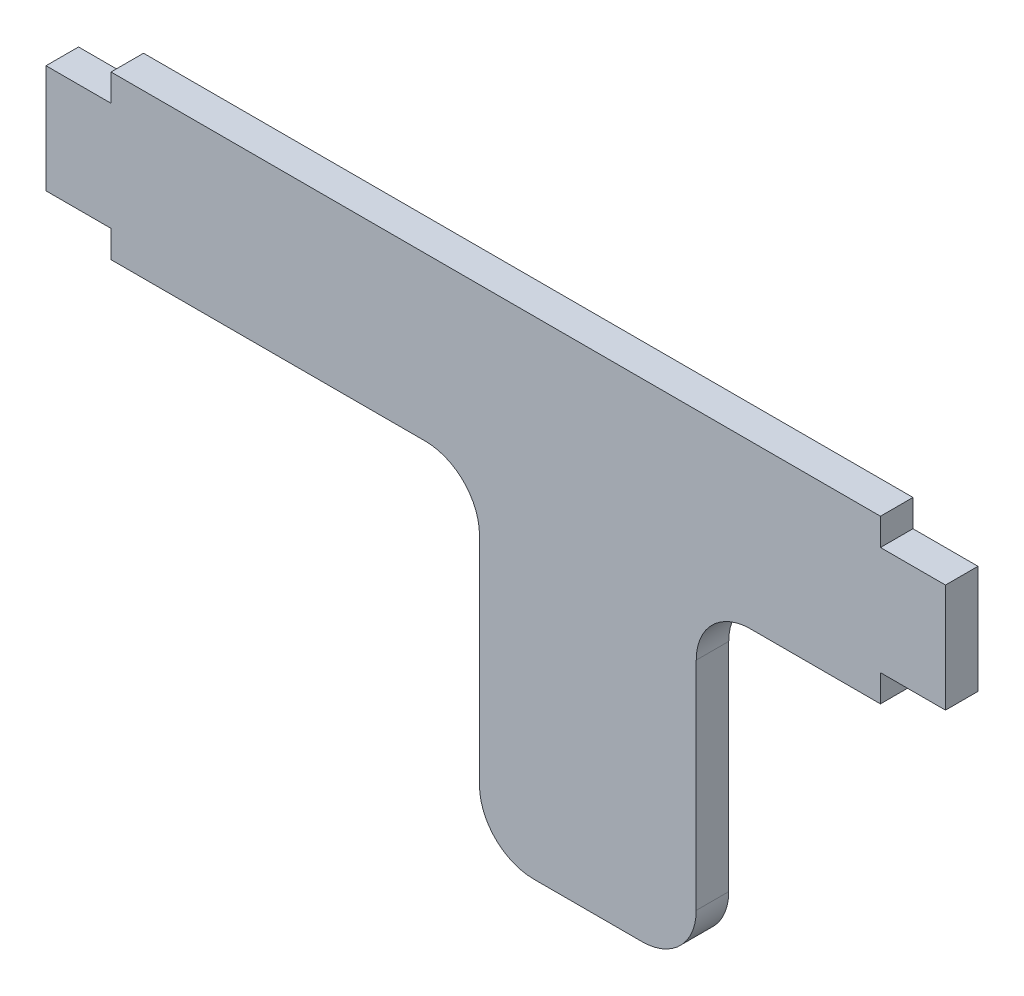
ISO-10303-21;
HEADER;
FILE_DESCRIPTION(('STEP AP214'),'2;1');
FILE_NAME('part.step','',(''),(''),'','','');
FILE_SCHEMA(('AUTOMOTIVE_DESIGN { 1 0 10303 214 1 1 1 1 }'));
ENDSEC;
DATA;
#1=APPLICATION_CONTEXT('core data for automotive mechanical design processes');
#2=APPLICATION_PROTOCOL_DEFINITION('international standard','automotive_design',2000,#1);
#3=PRODUCT_CONTEXT('',#1,'mechanical');
#4=PRODUCT('Part','Part','',(#3));
#5=PRODUCT_RELATED_PRODUCT_CATEGORY('part','',(#4));
#6=PRODUCT_DEFINITION_FORMATION('','',#4);
#7=PRODUCT_DEFINITION_CONTEXT('part definition',#1,'design');
#8=PRODUCT_DEFINITION('design','',#6,#7);
#9=PRODUCT_DEFINITION_SHAPE('','',#8);
#10=(LENGTH_UNIT() NAMED_UNIT(*) SI_UNIT(.MILLI.,.METRE.));
#11=(NAMED_UNIT(*) PLANE_ANGLE_UNIT() SI_UNIT($,.RADIAN.));
#12=(NAMED_UNIT(*) SI_UNIT($,.STERADIAN.) SOLID_ANGLE_UNIT());
#13=UNCERTAINTY_MEASURE_WITH_UNIT(LENGTH_MEASURE(1.E-05),#10,'distance_accuracy_value','');
#14=(GEOMETRIC_REPRESENTATION_CONTEXT(3) GLOBAL_UNCERTAINTY_ASSIGNED_CONTEXT((#13)) GLOBAL_UNIT_ASSIGNED_CONTEXT((#10,
#11,#12)) REPRESENTATION_CONTEXT('',''));
#15=CARTESIAN_POINT('',(0.,0.,0.));
#16=DIRECTION('',(0.,0.,1.));
#17=DIRECTION('',(1.,0.,0.));
#18=AXIS2_PLACEMENT_3D('',#15,#16,#17);
#19=CARTESIAN_POINT('',(-35.5,0.,3.));
#20=DIRECTION('',(-1.,0.,0.));
#21=DIRECTION('',(0.,0.,1.));
#22=AXIS2_PLACEMENT_3D('',#19,#20,#21);
#23=PLANE('',#22);
#24=DIRECTION('',(0.,1.,0.));
#25=VECTOR('',#24,1.);
#26=CARTESIAN_POINT('',(-35.5,0.,0.));
#27=LINE('',#26,#25);
#28=CARTESIAN_POINT('',(-35.5,-7.50000000000001,0.));
#29=VERTEX_POINT('',#28);
#30=CARTESIAN_POINT('',(-35.5,-5.,0.));
#31=VERTEX_POINT('',#30);
#32=EDGE_CURVE('E188',#29,#31,#27,.T.);
#33=ORIENTED_EDGE('',*,*,#32,.F.);
#34=DIRECTION('',(0.,0.,-1.));
#35=VECTOR('',#34,1.);
#36=CARTESIAN_POINT('',(-35.5,-7.50000000000001,3.));
#37=LINE('',#36,#35);
#38=CARTESIAN_POINT('',(-35.5,-7.50000000000001,3.));
#39=VERTEX_POINT('',#38);
#40=EDGE_CURVE('E176',#39,#29,#37,.T.);
#41=ORIENTED_EDGE('',*,*,#40,.F.);
#42=DIRECTION('',(0.,1.,0.));
#43=VECTOR('',#42,1.);
#44=CARTESIAN_POINT('',(-35.5,0.,3.));
#45=LINE('',#44,#43);
#46=CARTESIAN_POINT('',(-35.5,-5.,3.));
#47=VERTEX_POINT('',#46);
#48=EDGE_CURVE('E182',#39,#47,#45,.T.);
#49=ORIENTED_EDGE('',*,*,#48,.T.);
#50=DIRECTION('',(0.,0.,-1.));
#51=VECTOR('',#50,1.);
#52=CARTESIAN_POINT('',(-35.5,-5.,3.));
#53=LINE('',#52,#51);
#54=EDGE_CURVE('E225',#47,#31,#53,.T.);
#55=ORIENTED_EDGE('',*,*,#54,.T.);
#56=EDGE_LOOP('',(#33,#41,#49,#55));
#57=FACE_BOUND('',#56,.T.);
#58=ADVANCED_FACE('F35',(#57),#23,.T.);
#59=CARTESIAN_POINT('',(0.,-7.5,3.));
#60=DIRECTION('',(0.,-1.,0.));
#61=DIRECTION('',(1.,0.,0.));
#62=AXIS2_PLACEMENT_3D('',#59,#60,#61);
#63=PLANE('',#62);
#64=DIRECTION('',(-1.,0.,0.));
#65=VECTOR('',#64,1.);
#66=CARTESIAN_POINT('',(0.,-7.5,0.));
#67=LINE('',#66,#65);
#68=CARTESIAN_POINT('',(-6.5,-7.5,0.));
#69=VERTEX_POINT('',#68);
#70=EDGE_CURVE('E227',#69,#29,#67,.T.);
#71=ORIENTED_EDGE('',*,*,#70,.F.);
#72=DIRECTION('',(0.,0.,-1.));
#73=VECTOR('',#72,1.);
#74=CARTESIAN_POINT('',(-6.5,-7.5,3.));
#75=LINE('',#74,#73);
#76=CARTESIAN_POINT('',(-6.5,-7.5,3.));
#77=VERTEX_POINT('',#76);
#78=EDGE_CURVE('E179',#69,#77,#75,.F.);
#79=ORIENTED_EDGE('',*,*,#78,.T.);
#80=DIRECTION('',(-1.,0.,0.));
#81=VECTOR('',#80,1.);
#82=CARTESIAN_POINT('',(0.,-7.5,3.));
#83=LINE('',#82,#81);
#84=EDGE_CURVE('E172',#77,#39,#83,.T.);
#85=ORIENTED_EDGE('',*,*,#84,.T.);
#86=ORIENTED_EDGE('',*,*,#40,.T.);
#87=EDGE_LOOP('',(#71,#79,#85,#86));
#88=FACE_BOUND('',#87,.T.);
#89=ADVANCED_FACE('F175',(#88),#63,.T.);
#90=CARTESIAN_POINT('',(-1.49999999999999,0.,3.));
#91=DIRECTION('',(-1.,0.,0.));
#92=DIRECTION('',(0.,0.,1.));
#93=AXIS2_PLACEMENT_3D('',#90,#91,#92);
#94=PLANE('',#93);
#95=DIRECTION('',(0.,1.,0.));
#96=VECTOR('',#95,1.);
#97=CARTESIAN_POINT('',(-1.49999999999999,0.,0.));
#98=LINE('',#97,#96);
#99=CARTESIAN_POINT('',(-1.49999999999999,-32.5,0.));
#100=VERTEX_POINT('',#99);
#101=CARTESIAN_POINT('',(-1.49999999999999,-12.5,0.));
#102=VERTEX_POINT('',#101);
#103=EDGE_CURVE('E230',#100,#102,#98,.T.);
#104=ORIENTED_EDGE('',*,*,#103,.F.);
#105=DIRECTION('',(0.,0.,-1.));
#106=VECTOR('',#105,1.);
#107=CARTESIAN_POINT('',(-1.49999999999999,-32.5,3.));
#108=LINE('',#107,#106);
#109=CARTESIAN_POINT('',(-1.49999999999999,-32.5,3.));
#110=VERTEX_POINT('',#109);
#111=EDGE_CURVE('E302',#100,#110,#108,.F.);
#112=ORIENTED_EDGE('',*,*,#111,.T.);
#113=DIRECTION('',(0.,1.,0.));
#114=VECTOR('',#113,1.);
#115=CARTESIAN_POINT('',(-1.49999999999999,0.,3.));
#116=LINE('',#115,#114);
#117=CARTESIAN_POINT('',(-1.49999999999999,-12.5,3.));
#118=VERTEX_POINT('',#117);
#119=EDGE_CURVE('E181',#110,#118,#116,.T.);
#120=ORIENTED_EDGE('',*,*,#119,.T.);
#121=DIRECTION('',(0.,0.,-1.));
#122=VECTOR('',#121,1.);
#123=CARTESIAN_POINT('',(-1.49999999999999,-12.5,0.));
#124=LINE('',#123,#122);
#125=EDGE_CURVE('E299',#118,#102,#124,.T.);
#126=ORIENTED_EDGE('',*,*,#125,.T.);
#127=EDGE_LOOP('',(#104,#112,#120,#126));
#128=FACE_BOUND('',#127,.T.);
#129=ADVANCED_FACE('F370',(#128),#94,.T.);
#130=CARTESIAN_POINT('',(0.,-37.5,3.));
#131=DIRECTION('',(0.,-1.,0.));
#132=DIRECTION('',(0.,0.,-1.));
#133=AXIS2_PLACEMENT_3D('',#130,#131,#132);
#134=PLANE('',#133);
#135=DIRECTION('',(-1.,0.,0.));
#136=VECTOR('',#135,1.);
#137=CARTESIAN_POINT('',(0.,-37.5,0.));
#138=LINE('',#137,#136);
#139=CARTESIAN_POINT('',(13.5,-37.5,0.));
#140=VERTEX_POINT('',#139);
#141=CARTESIAN_POINT('',(3.50000000000001,-37.5,0.));
#142=VERTEX_POINT('',#141);
#143=EDGE_CURVE('E234',#140,#142,#138,.T.);
#144=ORIENTED_EDGE('',*,*,#143,.F.);
#145=DIRECTION('',(0.,0.,-1.));
#146=VECTOR('',#145,1.);
#147=CARTESIAN_POINT('',(13.5,-37.5,3.));
#148=LINE('',#147,#146);
#149=CARTESIAN_POINT('',(13.5,-37.5,3.));
#150=VERTEX_POINT('',#149);
#151=EDGE_CURVE('E293',#140,#150,#148,.F.);
#152=ORIENTED_EDGE('',*,*,#151,.T.);
#153=DIRECTION('',(-1.,0.,0.));
#154=VECTOR('',#153,1.);
#155=CARTESIAN_POINT('',(0.,-37.5,3.));
#156=LINE('',#155,#154);
#157=CARTESIAN_POINT('',(3.50000000000001,-37.5,3.));
#158=VERTEX_POINT('',#157);
#159=EDGE_CURVE('E328',#150,#158,#156,.T.);
#160=ORIENTED_EDGE('',*,*,#159,.T.);
#161=DIRECTION('',(0.,0.,-1.));
#162=VECTOR('',#161,1.);
#163=CARTESIAN_POINT('',(3.50000000000001,-37.5,3.));
#164=LINE('',#163,#162);
#165=EDGE_CURVE('E290',#158,#142,#164,.T.);
#166=ORIENTED_EDGE('',*,*,#165,.T.);
#167=EDGE_LOOP('',(#144,#152,#160,#166));
#168=FACE_BOUND('',#167,.T.);
#169=ADVANCED_FACE('F378',(#168),#134,.T.);
#170=CARTESIAN_POINT('',(18.5,0.,3.));
#171=DIRECTION('',(-1.,0.,0.));
#172=DIRECTION('',(0.,0.,1.));
#173=AXIS2_PLACEMENT_3D('',#170,#171,#172);
#174=PLANE('',#173);
#175=DIRECTION('',(0.,1.,0.));
#176=VECTOR('',#175,1.);
#177=CARTESIAN_POINT('',(18.5,0.,3.));
#178=LINE('',#177,#176);
#179=CARTESIAN_POINT('',(18.5,-32.5,3.));
#180=VERTEX_POINT('',#179);
#181=CARTESIAN_POINT('',(18.5,-12.5,3.));
#182=VERTEX_POINT('',#181);
#183=EDGE_CURVE('E326',#180,#182,#178,.T.);
#184=ORIENTED_EDGE('',*,*,#183,.F.);
#185=DIRECTION('',(0.,0.,-1.));
#186=VECTOR('',#185,1.);
#187=CARTESIAN_POINT('',(18.5,-32.5,0.));
#188=LINE('',#187,#186);
#189=CARTESIAN_POINT('',(18.5,-32.5,0.));
#190=VERTEX_POINT('',#189);
#191=EDGE_CURVE('E283',#180,#190,#188,.T.);
#192=ORIENTED_EDGE('',*,*,#191,.T.);
#193=DIRECTION('',(0.,1.,0.));
#194=VECTOR('',#193,1.);
#195=CARTESIAN_POINT('',(18.5,0.,0.));
#196=LINE('',#195,#194);
#197=CARTESIAN_POINT('',(18.5,-12.5,0.));
#198=VERTEX_POINT('',#197);
#199=EDGE_CURVE('E237',#190,#198,#196,.T.);
#200=ORIENTED_EDGE('',*,*,#199,.T.);
#201=DIRECTION('',(0.,0.,-1.));
#202=VECTOR('',#201,1.);
#203=CARTESIAN_POINT('',(18.5,-12.5,3.));
#204=LINE('',#203,#202);
#205=EDGE_CURVE('E189',#198,#182,#204,.F.);
#206=ORIENTED_EDGE('',*,*,#205,.T.);
#207=EDGE_LOOP('',(#184,#192,#200,#206));
#208=FACE_BOUND('',#207,.T.);
#209=ADVANCED_FACE('F321',(#208),#174,.F.);
#210=CARTESIAN_POINT('',(35.5,-7.5,3.));
#211=VERTEX_POINT('',#210);
#212=CARTESIAN_POINT('',(23.5,-7.5,3.));
#213=VERTEX_POINT('',#212);
#214=EDGE_CURVE('E184',#211,#213,#83,.T.);
#215=ORIENTED_EDGE('',*,*,#214,.T.);
#216=DIRECTION('',(0.,0.,-1.));
#217=VECTOR('',#216,1.);
#218=CARTESIAN_POINT('',(23.5,-7.5,3.));
#219=LINE('',#218,#217);
#220=CARTESIAN_POINT('',(23.5,-7.5,0.));
#221=VERTEX_POINT('',#220);
#222=EDGE_CURVE('E305',#213,#221,#219,.T.);
#223=ORIENTED_EDGE('',*,*,#222,.T.);
#224=CARTESIAN_POINT('',(35.5,-7.5,0.));
#225=VERTEX_POINT('',#224);
#226=EDGE_CURVE('E231',#225,#221,#67,.T.);
#227=ORIENTED_EDGE('',*,*,#226,.F.);
#228=DIRECTION('',(0.,0.,-1.));
#229=VECTOR('',#228,1.);
#230=CARTESIAN_POINT('',(35.5,-7.5,3.));
#231=LINE('',#230,#229);
#232=EDGE_CURVE('E190',#211,#225,#231,.T.);
#233=ORIENTED_EDGE('',*,*,#232,.F.);
#234=EDGE_LOOP('',(#215,#223,#227,#233));
#235=FACE_BOUND('',#234,.T.);
#236=ADVANCED_FACE('F324',(#235),#63,.T.);
#237=CARTESIAN_POINT('',(35.5,0.,3.));
#238=DIRECTION('',(-1.,0.,0.));
#239=DIRECTION('',(0.,0.,1.));
#240=AXIS2_PLACEMENT_3D('',#237,#238,#239);
#241=PLANE('',#240);
#242=DIRECTION('',(0.,1.,0.));
#243=VECTOR('',#242,1.);
#244=CARTESIAN_POINT('',(35.5,0.,0.));
#245=LINE('',#244,#243);
#246=CARTESIAN_POINT('',(35.5,-5.,0.));
#247=VERTEX_POINT('',#246);
#248=EDGE_CURVE('E240',#225,#247,#245,.T.);
#249=ORIENTED_EDGE('',*,*,#248,.T.);
#250=DIRECTION('',(0.,0.,-1.));
#251=VECTOR('',#250,1.);
#252=CARTESIAN_POINT('',(35.5,-5.,3.));
#253=LINE('',#252,#251);
#254=CARTESIAN_POINT('',(35.5,-5.,3.));
#255=VERTEX_POINT('',#254);
#256=EDGE_CURVE('E279',#255,#247,#253,.T.);
#257=ORIENTED_EDGE('',*,*,#256,.F.);
#258=DIRECTION('',(0.,1.,0.));
#259=VECTOR('',#258,1.);
#260=CARTESIAN_POINT('',(35.5,0.,3.));
#261=LINE('',#260,#259);
#262=EDGE_CURVE('E218',#211,#255,#261,.T.);
#263=ORIENTED_EDGE('',*,*,#262,.F.);
#264=ORIENTED_EDGE('',*,*,#232,.T.);
#265=EDGE_LOOP('',(#249,#257,#263,#264));
#266=FACE_BOUND('',#265,.T.);
#267=ADVANCED_FACE('F409',(#266),#241,.F.);
#268=CARTESIAN_POINT('',(0.,-5.,3.));
#269=DIRECTION('',(0.,-1.,0.));
#270=DIRECTION('',(0.,0.,-1.));
#271=AXIS2_PLACEMENT_3D('',#268,#269,#270);
#272=PLANE('',#271);
#273=DIRECTION('',(-1.,0.,0.));
#274=VECTOR('',#273,1.);
#275=CARTESIAN_POINT('',(0.,-5.,0.));
#276=LINE('',#275,#274);
#277=CARTESIAN_POINT('',(41.5,-5.,0.));
#278=VERTEX_POINT('',#277);
#279=EDGE_CURVE('E243',#278,#247,#276,.T.);
#280=ORIENTED_EDGE('',*,*,#279,.F.);
#281=DIRECTION('',(0.,0.,-1.));
#282=VECTOR('',#281,1.);
#283=CARTESIAN_POINT('',(41.5,-5.,3.));
#284=LINE('',#283,#282);
#285=CARTESIAN_POINT('',(41.5,-5.,3.));
#286=VERTEX_POINT('',#285);
#287=EDGE_CURVE('E277',#286,#278,#284,.T.);
#288=ORIENTED_EDGE('',*,*,#287,.F.);
#289=DIRECTION('',(-1.,0.,0.));
#290=VECTOR('',#289,1.);
#291=CARTESIAN_POINT('',(0.,-5.,3.));
#292=LINE('',#291,#290);
#293=EDGE_CURVE('E327',#286,#255,#292,.T.);
#294=ORIENTED_EDGE('',*,*,#293,.T.);
#295=ORIENTED_EDGE('',*,*,#256,.T.);
#296=EDGE_LOOP('',(#280,#288,#294,#295));
#297=FACE_BOUND('',#296,.T.);
#298=ADVANCED_FACE('F416',(#297),#272,.T.);
#299=CARTESIAN_POINT('',(41.5,0.,3.));
#300=DIRECTION('',(-1.,0.,0.));
#301=DIRECTION('',(0.,0.,1.));
#302=AXIS2_PLACEMENT_3D('',#299,#300,#301);
#303=PLANE('',#302);
#304=DIRECTION('',(0.,1.,0.));
#305=VECTOR('',#304,1.);
#306=CARTESIAN_POINT('',(41.5,0.,0.));
#307=LINE('',#306,#305);
#308=CARTESIAN_POINT('',(41.5,5.,0.));
#309=VERTEX_POINT('',#308);
#310=EDGE_CURVE('E247',#278,#309,#307,.T.);
#311=ORIENTED_EDGE('',*,*,#310,.T.);
#312=DIRECTION('',(0.,0.,-1.));
#313=VECTOR('',#312,1.);
#314=CARTESIAN_POINT('',(41.5,5.,3.));
#315=LINE('',#314,#313);
#316=CARTESIAN_POINT('',(41.5,5.,3.));
#317=VERTEX_POINT('',#316);
#318=EDGE_CURVE('E274',#317,#309,#315,.T.);
#319=ORIENTED_EDGE('',*,*,#318,.F.);
#320=DIRECTION('',(0.,1.,0.));
#321=VECTOR('',#320,1.);
#322=CARTESIAN_POINT('',(41.5,0.,3.));
#323=LINE('',#322,#321);
#324=EDGE_CURVE('E335',#286,#317,#323,.T.);
#325=ORIENTED_EDGE('',*,*,#324,.F.);
#326=ORIENTED_EDGE('',*,*,#287,.T.);
#327=EDGE_LOOP('',(#311,#319,#325,#326));
#328=FACE_BOUND('',#327,.T.);
#329=ADVANCED_FACE('F413',(#328),#303,.F.);
#330=CARTESIAN_POINT('',(0.,5.,3.));
#331=DIRECTION('',(0.,-1.,0.));
#332=DIRECTION('',(0.,0.,-1.));
#333=AXIS2_PLACEMENT_3D('',#330,#331,#332);
#334=PLANE('',#333);
#335=DIRECTION('',(-1.,0.,0.));
#336=VECTOR('',#335,1.);
#337=CARTESIAN_POINT('',(0.,5.,0.));
#338=LINE('',#337,#336);
#339=CARTESIAN_POINT('',(35.5,5.,0.));
#340=VERTEX_POINT('',#339);
#341=EDGE_CURVE('E249',#309,#340,#338,.T.);
#342=ORIENTED_EDGE('',*,*,#341,.T.);
#343=DIRECTION('',(0.,0.,-1.));
#344=VECTOR('',#343,1.);
#345=CARTESIAN_POINT('',(35.5,5.,3.));
#346=LINE('',#345,#344);
#347=CARTESIAN_POINT('',(35.5,5.,3.));
#348=VERTEX_POINT('',#347);
#349=EDGE_CURVE('E271',#348,#340,#346,.T.);
#350=ORIENTED_EDGE('',*,*,#349,.F.);
#351=DIRECTION('',(-1.,0.,0.));
#352=VECTOR('',#351,1.);
#353=CARTESIAN_POINT('',(0.,5.,3.));
#354=LINE('',#353,#352);
#355=EDGE_CURVE('E216',#317,#348,#354,.T.);
#356=ORIENTED_EDGE('',*,*,#355,.F.);
#357=ORIENTED_EDGE('',*,*,#318,.T.);
#358=EDGE_LOOP('',(#342,#350,#356,#357));
#359=FACE_BOUND('',#358,.T.);
#360=ADVANCED_FACE('F344',(#359),#334,.F.);
#361=CARTESIAN_POINT('',(35.5,7.5,0.));
#362=VERTEX_POINT('',#361);
#363=EDGE_CURVE('E244',#340,#362,#245,.T.);
#364=ORIENTED_EDGE('',*,*,#363,.T.);
#365=DIRECTION('',(0.,0.,-1.));
#366=VECTOR('',#365,1.);
#367=CARTESIAN_POINT('',(35.5,7.5,3.));
#368=LINE('',#367,#366);
#369=CARTESIAN_POINT('',(35.5,7.5,3.));
#370=VERTEX_POINT('',#369);
#371=EDGE_CURVE('E268',#370,#362,#368,.T.);
#372=ORIENTED_EDGE('',*,*,#371,.F.);
#373=EDGE_CURVE('E212',#348,#370,#261,.T.);
#374=ORIENTED_EDGE('',*,*,#373,.F.);
#375=ORIENTED_EDGE('',*,*,#349,.T.);
#376=EDGE_LOOP('',(#364,#372,#374,#375));
#377=FACE_BOUND('',#376,.T.);
#378=ADVANCED_FACE('F348',(#377),#241,.F.);
#379=CARTESIAN_POINT('',(0.,7.5,3.));
#380=DIRECTION('',(0.,-1.,0.));
#381=DIRECTION('',(1.,0.,0.));
#382=AXIS2_PLACEMENT_3D('',#379,#380,#381);
#383=PLANE('',#382);
#384=DIRECTION('',(-1.,0.,0.));
#385=VECTOR('',#384,1.);
#386=CARTESIAN_POINT('',(0.,7.5,0.));
#387=LINE('',#386,#385);
#388=CARTESIAN_POINT('',(-35.5,7.49999999999999,0.));
#389=VERTEX_POINT('',#388);
#390=EDGE_CURVE('E251',#362,#389,#387,.T.);
#391=ORIENTED_EDGE('',*,*,#390,.T.);
#392=DIRECTION('',(0.,0.,-1.));
#393=VECTOR('',#392,1.);
#394=CARTESIAN_POINT('',(-35.5,7.49999999999999,3.));
#395=LINE('',#394,#393);
#396=CARTESIAN_POINT('',(-35.5,7.49999999999999,3.));
#397=VERTEX_POINT('',#396);
#398=EDGE_CURVE('E266',#397,#389,#395,.T.);
#399=ORIENTED_EDGE('',*,*,#398,.F.);
#400=DIRECTION('',(-1.,0.,0.));
#401=VECTOR('',#400,1.);
#402=CARTESIAN_POINT('',(0.,7.5,3.));
#403=LINE('',#402,#401);
#404=EDGE_CURVE('E206',#370,#397,#403,.T.);
#405=ORIENTED_EDGE('',*,*,#404,.F.);
#406=ORIENTED_EDGE('',*,*,#371,.T.);
#407=EDGE_LOOP('',(#391,#399,#405,#406));
#408=FACE_BOUND('',#407,.T.);
#409=ADVANCED_FACE('F351',(#408),#383,.F.);
#410=CARTESIAN_POINT('',(-35.5,5.,0.));
#411=VERTEX_POINT('',#410);
#412=EDGE_CURVE('E228',#411,#389,#27,.T.);
#413=ORIENTED_EDGE('',*,*,#412,.F.);
#414=DIRECTION('',(0.,0.,-1.));
#415=VECTOR('',#414,1.);
#416=CARTESIAN_POINT('',(-35.5,5.,3.));
#417=LINE('',#416,#415);
#418=CARTESIAN_POINT('',(-35.5,5.,3.));
#419=VERTEX_POINT('',#418);
#420=EDGE_CURVE('E264',#419,#411,#417,.T.);
#421=ORIENTED_EDGE('',*,*,#420,.F.);
#422=EDGE_CURVE('E200',#419,#397,#45,.T.);
#423=ORIENTED_EDGE('',*,*,#422,.T.);
#424=ORIENTED_EDGE('',*,*,#398,.T.);
#425=EDGE_LOOP('',(#413,#421,#423,#424));
#426=FACE_BOUND('',#425,.T.);
#427=ADVANCED_FACE('F354',(#426),#23,.T.);
#428=CARTESIAN_POINT('',(0.,5.,3.));
#429=DIRECTION('',(0.,1.,0.));
#430=DIRECTION('',(0.,0.,1.));
#431=AXIS2_PLACEMENT_3D('',#428,#429,#430);
#432=PLANE('',#431);
#433=DIRECTION('',(1.,0.,0.));
#434=VECTOR('',#433,1.);
#435=CARTESIAN_POINT('',(0.,5.,0.));
#436=LINE('',#435,#434);
#437=CARTESIAN_POINT('',(-41.5,5.,0.));
#438=VERTEX_POINT('',#437);
#439=EDGE_CURVE('E254',#438,#411,#436,.T.);
#440=ORIENTED_EDGE('',*,*,#439,.F.);
#441=DIRECTION('',(0.,0.,-1.));
#442=VECTOR('',#441,1.);
#443=CARTESIAN_POINT('',(-41.5,5.,3.));
#444=LINE('',#443,#442);
#445=CARTESIAN_POINT('',(-41.5,5.,3.));
#446=VERTEX_POINT('',#445);
#447=EDGE_CURVE('E262',#446,#438,#444,.T.);
#448=ORIENTED_EDGE('',*,*,#447,.F.);
#449=DIRECTION('',(1.,0.,0.));
#450=VECTOR('',#449,1.);
#451=CARTESIAN_POINT('',(0.,5.,3.));
#452=LINE('',#451,#450);
#453=EDGE_CURVE('E205',#446,#419,#452,.T.);
#454=ORIENTED_EDGE('',*,*,#453,.T.);
#455=ORIENTED_EDGE('',*,*,#420,.T.);
#456=EDGE_LOOP('',(#440,#448,#454,#455));
#457=FACE_BOUND('',#456,.T.);
#458=ADVANCED_FACE('F359',(#457),#432,.T.);
#459=CARTESIAN_POINT('',(-41.5,0.,3.));
#460=DIRECTION('',(-1.,0.,0.));
#461=DIRECTION('',(0.,0.,1.));
#462=AXIS2_PLACEMENT_3D('',#459,#460,#461);
#463=PLANE('',#462);
#464=DIRECTION('',(0.,1.,0.));
#465=VECTOR('',#464,1.);
#466=CARTESIAN_POINT('',(-41.5,0.,0.));
#467=LINE('',#466,#465);
#468=CARTESIAN_POINT('',(-41.5,-5.,0.));
#469=VERTEX_POINT('',#468);
#470=EDGE_CURVE('E202',#469,#438,#467,.T.);
#471=ORIENTED_EDGE('',*,*,#470,.F.);
#472=DIRECTION('',(0.,0.,-1.));
#473=VECTOR('',#472,1.);
#474=CARTESIAN_POINT('',(-41.5,-5.,3.));
#475=LINE('',#474,#473);
#476=CARTESIAN_POINT('',(-41.5,-5.,3.));
#477=VERTEX_POINT('',#476);
#478=EDGE_CURVE('E260',#477,#469,#475,.T.);
#479=ORIENTED_EDGE('',*,*,#478,.F.);
#480=DIRECTION('',(0.,1.,0.));
#481=VECTOR('',#480,1.);
#482=CARTESIAN_POINT('',(-41.5,0.,3.));
#483=LINE('',#482,#481);
#484=EDGE_CURVE('E210',#477,#446,#483,.T.);
#485=ORIENTED_EDGE('',*,*,#484,.T.);
#486=ORIENTED_EDGE('',*,*,#447,.T.);
#487=EDGE_LOOP('',(#471,#479,#485,#486));
#488=FACE_BOUND('',#487,.T.);
#489=ADVANCED_FACE('F362',(#488),#463,.T.);
#490=CARTESIAN_POINT('',(0.,-5.,3.));
#491=DIRECTION('',(0.,1.,0.));
#492=DIRECTION('',(0.,0.,1.));
#493=AXIS2_PLACEMENT_3D('',#490,#491,#492);
#494=PLANE('',#493);
#495=DIRECTION('',(1.,0.,0.));
#496=VECTOR('',#495,1.);
#497=CARTESIAN_POINT('',(0.,-5.,0.));
#498=LINE('',#497,#496);
#499=EDGE_CURVE('E198',#469,#31,#498,.T.);
#500=ORIENTED_EDGE('',*,*,#499,.T.);
#501=ORIENTED_EDGE('',*,*,#54,.F.);
#502=DIRECTION('',(1.,0.,0.));
#503=VECTOR('',#502,1.);
#504=CARTESIAN_POINT('',(0.,-5.,3.));
#505=LINE('',#504,#503);
#506=EDGE_CURVE('E196',#477,#47,#505,.T.);
#507=ORIENTED_EDGE('',*,*,#506,.F.);
#508=ORIENTED_EDGE('',*,*,#478,.T.);
#509=EDGE_LOOP('',(#500,#501,#507,#508));
#510=FACE_BOUND('',#509,.T.);
#511=ADVANCED_FACE('F364',(#510),#494,.F.);
#512=CARTESIAN_POINT('',(0.,0.,3.));
#513=DIRECTION('',(0.,0.,1.));
#514=DIRECTION('',(1.,0.,0.));
#515=AXIS2_PLACEMENT_3D('',#512,#513,#514);
#516=PLANE('',#515);
#517=ORIENTED_EDGE('',*,*,#159,.F.);
#518=CARTESIAN_POINT('',(13.5,-32.5,3.));
#519=DIRECTION('',(0.,0.,1.));
#520=DIRECTION('',(1.,0.,0.));
#521=AXIS2_PLACEMENT_3D('',#518,#519,#520);
#522=CIRCLE('',#521,5.);
#523=EDGE_CURVE('E297',#150,#180,#522,.T.);
#524=ORIENTED_EDGE('',*,*,#523,.T.);
#525=ORIENTED_EDGE('',*,*,#183,.T.);
#526=CARTESIAN_POINT('',(23.5,-12.5,3.));
#527=DIRECTION('',(0.,0.,1.));
#528=DIRECTION('',(1.,0.,0.));
#529=AXIS2_PLACEMENT_3D('',#526,#527,#528);
#530=CIRCLE('',#529,5.);
#531=EDGE_CURVE('E11',#182,#213,#530,.F.);
#532=ORIENTED_EDGE('',*,*,#531,.T.);
#533=ORIENTED_EDGE('',*,*,#214,.F.);
#534=ORIENTED_EDGE('',*,*,#262,.T.);
#535=ORIENTED_EDGE('',*,*,#293,.F.);
#536=ORIENTED_EDGE('',*,*,#324,.T.);
#537=ORIENTED_EDGE('',*,*,#355,.T.);
#538=ORIENTED_EDGE('',*,*,#373,.T.);
#539=ORIENTED_EDGE('',*,*,#404,.T.);
#540=ORIENTED_EDGE('',*,*,#422,.F.);
#541=ORIENTED_EDGE('',*,*,#453,.F.);
#542=ORIENTED_EDGE('',*,*,#484,.F.);
#543=ORIENTED_EDGE('',*,*,#506,.T.);
#544=ORIENTED_EDGE('',*,*,#48,.F.);
#545=ORIENTED_EDGE('',*,*,#84,.F.);
#546=CARTESIAN_POINT('',(-6.49999999999999,-12.5,3.));
#547=DIRECTION('',(0.,0.,1.));
#548=DIRECTION('',(1.,0.,0.));
#549=AXIS2_PLACEMENT_3D('',#546,#547,#548);
#550=CIRCLE('',#549,5.);
#551=EDGE_CURVE('E55',#77,#118,#550,.F.);
#552=ORIENTED_EDGE('',*,*,#551,.T.);
#553=ORIENTED_EDGE('',*,*,#119,.F.);
#554=CARTESIAN_POINT('',(3.50000000000001,-32.5,3.));
#555=DIRECTION('',(0.,0.,1.));
#556=DIRECTION('',(1.,0.,0.));
#557=AXIS2_PLACEMENT_3D('',#554,#555,#556);
#558=CIRCLE('',#557,5.);
#559=EDGE_CURVE('E295',#110,#158,#558,.T.);
#560=ORIENTED_EDGE('',*,*,#559,.T.);
#561=EDGE_LOOP('',(#517,#524,#525,#532,#533,#534,#535,#536,#537,#538,#539,#540,#541,#542,#543,
#544,#545,#552,#553,#560));
#562=FACE_BOUND('',#561,.T.);
#563=ADVANCED_FACE('F193',(#562),#516,.T.);
#564=CARTESIAN_POINT('',(0.,0.,0.));
#565=DIRECTION('',(0.,0.,1.));
#566=DIRECTION('',(1.,0.,0.));
#567=AXIS2_PLACEMENT_3D('',#564,#565,#566);
#568=PLANE('',#567);
#569=ORIENTED_EDGE('',*,*,#199,.F.);
#570=CARTESIAN_POINT('',(13.5,-32.5,0.));
#571=DIRECTION('',(0.,0.,1.));
#572=DIRECTION('',(1.,0.,0.));
#573=AXIS2_PLACEMENT_3D('',#570,#571,#572);
#574=CIRCLE('',#573,5.);
#575=EDGE_CURVE('E288',#190,#140,#574,.F.);
#576=ORIENTED_EDGE('',*,*,#575,.T.);
#577=ORIENTED_EDGE('',*,*,#143,.T.);
#578=CARTESIAN_POINT('',(3.50000000000001,-32.5,0.));
#579=DIRECTION('',(0.,0.,1.));
#580=DIRECTION('',(1.,0.,0.));
#581=AXIS2_PLACEMENT_3D('',#578,#579,#580);
#582=CIRCLE('',#581,5.);
#583=EDGE_CURVE('E286',#142,#100,#582,.F.);
#584=ORIENTED_EDGE('',*,*,#583,.T.);
#585=ORIENTED_EDGE('',*,*,#103,.T.);
#586=CARTESIAN_POINT('',(-6.49999999999999,-12.5,0.));
#587=DIRECTION('',(0.,0.,1.));
#588=DIRECTION('',(1.,0.,0.));
#589=AXIS2_PLACEMENT_3D('',#586,#587,#588);
#590=CIRCLE('',#589,5.);
#591=EDGE_CURVE('E308',#102,#69,#590,.T.);
#592=ORIENTED_EDGE('',*,*,#591,.T.);
#593=ORIENTED_EDGE('',*,*,#70,.T.);
#594=ORIENTED_EDGE('',*,*,#32,.T.);
#595=ORIENTED_EDGE('',*,*,#499,.F.);
#596=ORIENTED_EDGE('',*,*,#470,.T.);
#597=ORIENTED_EDGE('',*,*,#439,.T.);
#598=ORIENTED_EDGE('',*,*,#412,.T.);
#599=ORIENTED_EDGE('',*,*,#390,.F.);
#600=ORIENTED_EDGE('',*,*,#363,.F.);
#601=ORIENTED_EDGE('',*,*,#341,.F.);
#602=ORIENTED_EDGE('',*,*,#310,.F.);
#603=ORIENTED_EDGE('',*,*,#279,.T.);
#604=ORIENTED_EDGE('',*,*,#248,.F.);
#605=ORIENTED_EDGE('',*,*,#226,.T.);
#606=CARTESIAN_POINT('',(23.5,-12.5,0.));
#607=DIRECTION('',(0.,0.,1.));
#608=DIRECTION('',(1.,0.,0.));
#609=AXIS2_PLACEMENT_3D('',#606,#607,#608);
#610=CIRCLE('',#609,5.);
#611=EDGE_CURVE('E43',#221,#198,#610,.T.);
#612=ORIENTED_EDGE('',*,*,#611,.T.);
#613=EDGE_LOOP('',(#569,#576,#577,#584,#585,#592,#593,#594,#595,#596,#597,#598,#599,#600,#601,
#602,#603,#604,#605,#612));
#614=FACE_BOUND('',#613,.T.);
#615=ADVANCED_FACE('F313',(#614),#568,.F.);
#616=CARTESIAN_POINT('',(13.5,-32.5,3.));
#617=DIRECTION('',(0.,0.,1.));
#618=DIRECTION('',(1.,0.,0.));
#619=AXIS2_PLACEMENT_3D('',#616,#617,#618);
#620=CYLINDRICAL_SURFACE('',#619,5.);
#621=ORIENTED_EDGE('',*,*,#523,.F.);
#622=ORIENTED_EDGE('',*,*,#151,.F.);
#623=ORIENTED_EDGE('',*,*,#575,.F.);
#624=ORIENTED_EDGE('',*,*,#191,.F.);
#625=EDGE_LOOP('',(#621,#622,#623,#624));
#626=FACE_BOUND('',#625,.T.);
#627=ADVANCED_FACE('F382',(#626),#620,.T.);
#628=CARTESIAN_POINT('',(3.50000000000001,-32.5,3.));
#629=DIRECTION('',(0.,0.,-1.));
#630=DIRECTION('',(-1.,0.,0.));
#631=AXIS2_PLACEMENT_3D('',#628,#629,#630);
#632=CYLINDRICAL_SURFACE('',#631,5.);
#633=ORIENTED_EDGE('',*,*,#559,.F.);
#634=ORIENTED_EDGE('',*,*,#111,.F.);
#635=ORIENTED_EDGE('',*,*,#583,.F.);
#636=ORIENTED_EDGE('',*,*,#165,.F.);
#637=EDGE_LOOP('',(#633,#634,#635,#636));
#638=FACE_BOUND('',#637,.T.);
#639=ADVANCED_FACE('F376',(#638),#632,.T.);
#640=CARTESIAN_POINT('',(-6.49999999999999,-12.5,3.));
#641=DIRECTION('',(0.,0.,1.));
#642=DIRECTION('',(1.,0.,0.));
#643=AXIS2_PLACEMENT_3D('',#640,#641,#642);
#644=CYLINDRICAL_SURFACE('',#643,5.);
#645=ORIENTED_EDGE('',*,*,#551,.F.);
#646=ORIENTED_EDGE('',*,*,#78,.F.);
#647=ORIENTED_EDGE('',*,*,#591,.F.);
#648=ORIENTED_EDGE('',*,*,#125,.F.);
#649=EDGE_LOOP('',(#645,#646,#647,#648));
#650=FACE_BOUND('',#649,.T.);
#651=ADVANCED_FACE('F366',(#650),#644,.F.);
#652=CARTESIAN_POINT('',(23.5,-12.5,3.));
#653=DIRECTION('',(0.,0.,-1.));
#654=DIRECTION('',(-1.,0.,0.));
#655=AXIS2_PLACEMENT_3D('',#652,#653,#654);
#656=CYLINDRICAL_SURFACE('',#655,5.);
#657=ORIENTED_EDGE('',*,*,#531,.F.);
#658=ORIENTED_EDGE('',*,*,#205,.F.);
#659=ORIENTED_EDGE('',*,*,#611,.F.);
#660=ORIENTED_EDGE('',*,*,#222,.F.);
#661=EDGE_LOOP('',(#657,#658,#659,#660));
#662=FACE_BOUND('',#661,.T.);
#663=ADVANCED_FACE('F37',(#662),#656,.F.);
#664=CLOSED_SHELL('',(#58,#89,#129,#169,#209,#236,#267,#298,#329,#360,#378,#409,#427,#458,#489,
#511,#563,#615,#627,#639,#651,#663));
#665=MANIFOLD_SOLID_BREP('B2',#664);
#666=ADVANCED_BREP_SHAPE_REPRESENTATION('',(#18,#665),#14);
#667=SHAPE_DEFINITION_REPRESENTATION(#9,#666);
ENDSEC;
END-ISO-10303-21;
